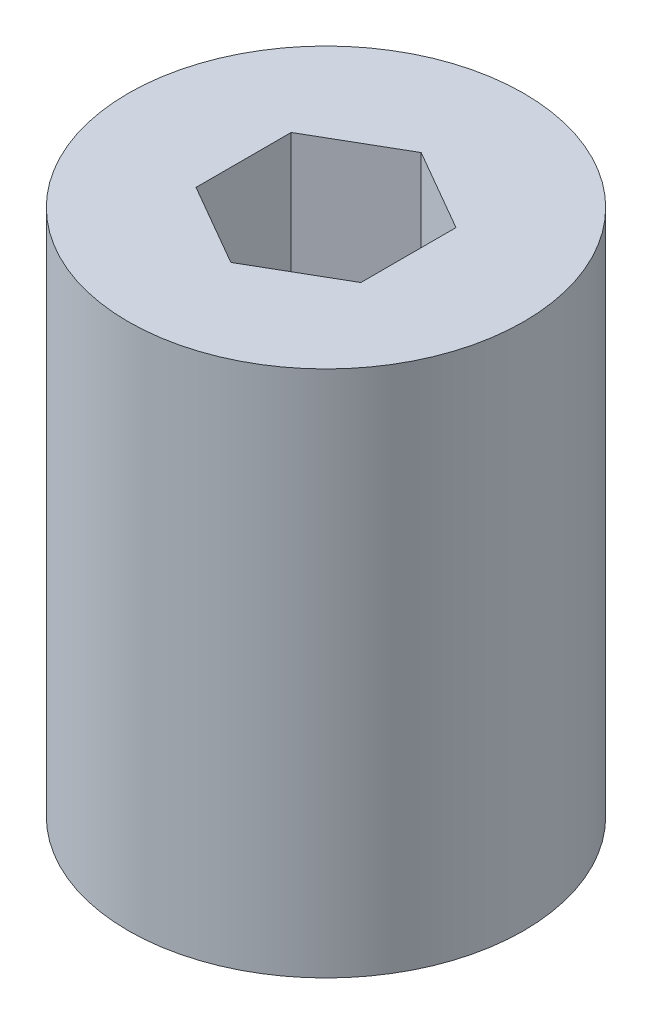
ISO-10303-21;
HEADER;
FILE_DESCRIPTION(('STEP AP214'),'2;1');
FILE_NAME('part.step','',(''),(''),'','','');
FILE_SCHEMA(('AUTOMOTIVE_DESIGN { 1 0 10303 214 1 1 1 1 }'));
ENDSEC;
DATA;
#1=APPLICATION_CONTEXT('core data for automotive mechanical design processes');
#2=APPLICATION_PROTOCOL_DEFINITION('international standard','automotive_design',2000,#1);
#3=PRODUCT_CONTEXT('',#1,'mechanical');
#4=PRODUCT('Part','Part','',(#3));
#5=PRODUCT_RELATED_PRODUCT_CATEGORY('part','',(#4));
#6=PRODUCT_DEFINITION_FORMATION('','',#4);
#7=PRODUCT_DEFINITION_CONTEXT('part definition',#1,'design');
#8=PRODUCT_DEFINITION('design','',#6,#7);
#9=PRODUCT_DEFINITION_SHAPE('','',#8);
#10=(LENGTH_UNIT() NAMED_UNIT(*) SI_UNIT(.MILLI.,.METRE.));
#11=(NAMED_UNIT(*) PLANE_ANGLE_UNIT() SI_UNIT($,.RADIAN.));
#12=(NAMED_UNIT(*) SI_UNIT($,.STERADIAN.) SOLID_ANGLE_UNIT());
#13=UNCERTAINTY_MEASURE_WITH_UNIT(LENGTH_MEASURE(1.E-05),#10,'distance_accuracy_value','');
#14=(GEOMETRIC_REPRESENTATION_CONTEXT(3) GLOBAL_UNCERTAINTY_ASSIGNED_CONTEXT((#13)) GLOBAL_UNIT_ASSIGNED_CONTEXT((#10,
#11,#12)) REPRESENTATION_CONTEXT('',''));
#15=CARTESIAN_POINT('',(0.,0.,0.));
#16=DIRECTION('',(0.,0.,1.));
#17=DIRECTION('',(1.,0.,0.));
#18=AXIS2_PLACEMENT_3D('',#15,#16,#17);
#19=CARTESIAN_POINT('',(0.,0.,0.));
#20=DIRECTION('',(0.,-1.,0.));
#21=DIRECTION('',(0.,0.,-1.));
#22=AXIS2_PLACEMENT_3D('',#19,#20,#21);
#23=PLANE('',#22);
#24=CARTESIAN_POINT('',(0.,0.,0.));
#25=DIRECTION('',(0.,-1.,0.));
#26=DIRECTION('',(0.,0.,-1.));
#27=AXIS2_PLACEMENT_3D('',#24,#25,#26);
#28=CIRCLE('',#27,6.);
#29=CARTESIAN_POINT('',(0.,0.,-6.));
#30=VERTEX_POINT('',#29);
#31=EDGE_CURVE('E9',#30,#30,#28,.T.);
#32=ORIENTED_EDGE('',*,*,#31,.F.);
#33=EDGE_LOOP('',(#32));
#34=FACE_BOUND('',#33,.T.);
#35=DIRECTION('',(0.,0.,1.));
#36=VECTOR('',#35,1.);
#37=CARTESIAN_POINT('',(2.5,0.,0.));
#38=LINE('',#37,#36);
#39=CARTESIAN_POINT('',(2.5,0.,-1.44337567297406));
#40=VERTEX_POINT('',#39);
#41=CARTESIAN_POINT('',(2.5,0.,1.44337567297406));
#42=VERTEX_POINT('',#41);
#43=EDGE_CURVE('E95',#40,#42,#38,.T.);
#44=ORIENTED_EDGE('',*,*,#43,.T.);
#45=DIRECTION('',(-0.866025403784439,0.,0.5));
#46=VECTOR('',#45,1.);
#47=CARTESIAN_POINT('',(1.25,0.,2.16506350946109));
#48=LINE('',#47,#46);
#49=CARTESIAN_POINT('',(0.,0.,2.88675134594813));
#50=VERTEX_POINT('',#49);
#51=EDGE_CURVE('E74',#42,#50,#48,.T.);
#52=ORIENTED_EDGE('',*,*,#51,.T.);
#53=DIRECTION('',(-0.866025403784439,0.,-0.5));
#54=VECTOR('',#53,1.);
#55=CARTESIAN_POINT('',(-1.25,0.,2.16506350946109));
#56=LINE('',#55,#54);
#57=CARTESIAN_POINT('',(-2.5,0.,1.44337567297406));
#58=VERTEX_POINT('',#57);
#59=EDGE_CURVE('E155',#50,#58,#56,.T.);
#60=ORIENTED_EDGE('',*,*,#59,.T.);
#61=DIRECTION('',(0.,0.,-1.));
#62=VECTOR('',#61,1.);
#63=CARTESIAN_POINT('',(-2.5,0.,0.));
#64=LINE('',#63,#62);
#65=CARTESIAN_POINT('',(-2.5,0.,-1.44337567297406));
#66=VERTEX_POINT('',#65);
#67=EDGE_CURVE('E122',#58,#66,#64,.T.);
#68=ORIENTED_EDGE('',*,*,#67,.T.);
#69=DIRECTION('',(0.866025403784439,0.,-0.5));
#70=VECTOR('',#69,1.);
#71=CARTESIAN_POINT('',(-1.25,0.,-2.16506350946109));
#72=LINE('',#71,#70);
#73=CARTESIAN_POINT('',(0.,0.,-2.88675134594813));
#74=VERTEX_POINT('',#73);
#75=EDGE_CURVE('E18',#66,#74,#72,.T.);
#76=ORIENTED_EDGE('',*,*,#75,.T.);
#77=DIRECTION('',(0.866025403784439,0.,0.5));
#78=VECTOR('',#77,1.);
#79=CARTESIAN_POINT('',(1.25,0.,-2.16506350946109));
#80=LINE('',#79,#78);
#81=EDGE_CURVE('E99',#74,#40,#80,.T.);
#82=ORIENTED_EDGE('',*,*,#81,.T.);
#83=EDGE_LOOP('',(#44,#52,#60,#68,#76,#82));
#84=FACE_BOUND('',#83,.T.);
#85=ADVANCED_FACE('F14',(#34,#84),#23,.F.);
#86=CARTESIAN_POINT('',(0.,-16.,0.));
#87=DIRECTION('',(0.,-1.,0.));
#88=DIRECTION('',(0.,0.,-1.));
#89=AXIS2_PLACEMENT_3D('',#86,#87,#88);
#90=PLANE('',#89);
#91=CARTESIAN_POINT('',(0.,-16.,0.));
#92=DIRECTION('',(0.,-1.,0.));
#93=DIRECTION('',(0.,0.,-1.));
#94=AXIS2_PLACEMENT_3D('',#91,#92,#93);
#95=CIRCLE('',#94,6.);
#96=CARTESIAN_POINT('',(0.,-16.,-6.));
#97=VERTEX_POINT('',#96);
#98=EDGE_CURVE('E25',#97,#97,#95,.T.);
#99=ORIENTED_EDGE('',*,*,#98,.T.);
#100=EDGE_LOOP('',(#99));
#101=FACE_BOUND('',#100,.T.);
#102=DIRECTION('',(0.,0.,1.));
#103=VECTOR('',#102,1.);
#104=CARTESIAN_POINT('',(2.5,-16.,0.));
#105=LINE('',#104,#103);
#106=CARTESIAN_POINT('',(2.5,-16.,-1.44337567297406));
#107=VERTEX_POINT('',#106);
#108=CARTESIAN_POINT('',(2.5,-16.,1.44337567297406));
#109=VERTEX_POINT('',#108);
#110=EDGE_CURVE('E97',#107,#109,#105,.T.);
#111=ORIENTED_EDGE('',*,*,#110,.F.);
#112=DIRECTION('',(0.866025403784439,0.,0.5));
#113=VECTOR('',#112,1.);
#114=CARTESIAN_POINT('',(1.25,-16.,-2.16506350946109));
#115=LINE('',#114,#113);
#116=CARTESIAN_POINT('',(0.,-16.,-2.88675134594813));
#117=VERTEX_POINT('',#116);
#118=EDGE_CURVE('E147',#117,#107,#115,.T.);
#119=ORIENTED_EDGE('',*,*,#118,.F.);
#120=DIRECTION('',(0.866025403784439,0.,-0.5));
#121=VECTOR('',#120,1.);
#122=CARTESIAN_POINT('',(-1.25,-16.,-2.16506350946109));
#123=LINE('',#122,#121);
#124=CARTESIAN_POINT('',(-2.5,-16.,-1.44337567297406));
#125=VERTEX_POINT('',#124);
#126=EDGE_CURVE('E127',#125,#117,#123,.T.);
#127=ORIENTED_EDGE('',*,*,#126,.F.);
#128=DIRECTION('',(0.,0.,-1.));
#129=VECTOR('',#128,1.);
#130=CARTESIAN_POINT('',(-2.5,-16.,0.));
#131=LINE('',#130,#129);
#132=CARTESIAN_POINT('',(-2.5,-16.,1.44337567297406));
#133=VERTEX_POINT('',#132);
#134=EDGE_CURVE('E121',#133,#125,#131,.T.);
#135=ORIENTED_EDGE('',*,*,#134,.F.);
#136=DIRECTION('',(-0.866025403784439,0.,-0.5));
#137=VECTOR('',#136,1.);
#138=CARTESIAN_POINT('',(-1.25,-16.,2.16506350946109));
#139=LINE('',#138,#137);
#140=CARTESIAN_POINT('',(0.,-16.,2.88675134594813));
#141=VERTEX_POINT('',#140);
#142=EDGE_CURVE('E90',#141,#133,#139,.T.);
#143=ORIENTED_EDGE('',*,*,#142,.F.);
#144=DIRECTION('',(-0.866025403784439,0.,0.5));
#145=VECTOR('',#144,1.);
#146=CARTESIAN_POINT('',(1.25,-16.,2.16506350946109));
#147=LINE('',#146,#145);
#148=EDGE_CURVE('E61',#109,#141,#147,.T.);
#149=ORIENTED_EDGE('',*,*,#148,.F.);
#150=EDGE_LOOP('',(#111,#119,#127,#135,#143,#149));
#151=FACE_BOUND('',#150,.T.);
#152=ADVANCED_FACE('F161',(#101,#151),#90,.T.);
#153=CARTESIAN_POINT('',(0.,-16.,0.));
#154=DIRECTION('',(0.,1.,0.));
#155=DIRECTION('',(0.,0.,1.));
#156=AXIS2_PLACEMENT_3D('',#153,#154,#155);
#157=CYLINDRICAL_SURFACE('',#156,6.);
#158=ORIENTED_EDGE('',*,*,#31,.T.);
#159=EDGE_LOOP('',(#158));
#160=FACE_BOUND('',#159,.T.);
#161=ORIENTED_EDGE('',*,*,#98,.F.);
#162=EDGE_LOOP('',(#161));
#163=FACE_BOUND('',#162,.T.);
#164=ADVANCED_FACE('F16',(#160,#163),#157,.T.);
#165=CARTESIAN_POINT('',(1.25,-16.,2.16506350946109));
#166=DIRECTION('',(-0.5,0.,-0.866025403784439));
#167=DIRECTION('',(-0.866025403784439,0.,0.5));
#168=AXIS2_PLACEMENT_3D('',#165,#166,#167);
#169=PLANE('',#168);
#170=ORIENTED_EDGE('',*,*,#51,.F.);
#171=DIRECTION('',(0.,1.,0.));
#172=VECTOR('',#171,1.);
#173=CARTESIAN_POINT('',(2.5,-16.,1.44337567297406));
#174=LINE('',#173,#172);
#175=EDGE_CURVE('E84',#109,#42,#174,.T.);
#176=ORIENTED_EDGE('',*,*,#175,.F.);
#177=ORIENTED_EDGE('',*,*,#148,.T.);
#178=DIRECTION('',(0.,1.,0.));
#179=VECTOR('',#178,1.);
#180=CARTESIAN_POINT('',(0.,-16.,2.88675134594813));
#181=LINE('',#180,#179);
#182=EDGE_CURVE('E87',#141,#50,#181,.T.);
#183=ORIENTED_EDGE('',*,*,#182,.T.);
#184=EDGE_LOOP('',(#170,#176,#177,#183));
#185=FACE_BOUND('',#184,.T.);
#186=ADVANCED_FACE('F83',(#185),#169,.T.);
#187=CARTESIAN_POINT('',(-1.25,-16.,2.16506350946109));
#188=DIRECTION('',(0.5,0.,-0.866025403784439));
#189=DIRECTION('',(0.,-1.,0.));
#190=AXIS2_PLACEMENT_3D('',#187,#188,#189);
#191=PLANE('',#190);
#192=ORIENTED_EDGE('',*,*,#59,.F.);
#193=ORIENTED_EDGE('',*,*,#182,.F.);
#194=ORIENTED_EDGE('',*,*,#142,.T.);
#195=DIRECTION('',(0.,1.,0.));
#196=VECTOR('',#195,1.);
#197=CARTESIAN_POINT('',(-2.5,-16.,1.44337567297406));
#198=LINE('',#197,#196);
#199=EDGE_CURVE('E117',#133,#58,#198,.T.);
#200=ORIENTED_EDGE('',*,*,#199,.T.);
#201=EDGE_LOOP('',(#192,#193,#194,#200));
#202=FACE_BOUND('',#201,.T.);
#203=ADVANCED_FACE('F170',(#202),#191,.T.);
#204=CARTESIAN_POINT('',(-2.5,-16.,0.));
#205=DIRECTION('',(1.,0.,0.));
#206=DIRECTION('',(0.,0.,1.));
#207=AXIS2_PLACEMENT_3D('',#204,#205,#206);
#208=PLANE('',#207);
#209=ORIENTED_EDGE('',*,*,#67,.F.);
#210=ORIENTED_EDGE('',*,*,#199,.F.);
#211=ORIENTED_EDGE('',*,*,#134,.T.);
#212=DIRECTION('',(0.,1.,0.));
#213=VECTOR('',#212,1.);
#214=CARTESIAN_POINT('',(-2.5,-16.,-1.44337567297406));
#215=LINE('',#214,#213);
#216=EDGE_CURVE('E123',#125,#66,#215,.T.);
#217=ORIENTED_EDGE('',*,*,#216,.T.);
#218=EDGE_LOOP('',(#209,#210,#211,#217));
#219=FACE_BOUND('',#218,.T.);
#220=ADVANCED_FACE('F180',(#219),#208,.T.);
#221=CARTESIAN_POINT('',(-1.25,-16.,-2.16506350946109));
#222=DIRECTION('',(0.5,0.,0.866025403784439));
#223=DIRECTION('',(0.,-1.,0.));
#224=AXIS2_PLACEMENT_3D('',#221,#222,#223);
#225=PLANE('',#224);
#226=ORIENTED_EDGE('',*,*,#75,.F.);
#227=ORIENTED_EDGE('',*,*,#216,.F.);
#228=ORIENTED_EDGE('',*,*,#126,.T.);
#229=DIRECTION('',(0.,1.,0.));
#230=VECTOR('',#229,1.);
#231=CARTESIAN_POINT('',(0.,-16.,-2.88675134594813));
#232=LINE('',#231,#230);
#233=EDGE_CURVE('E116',#117,#74,#232,.T.);
#234=ORIENTED_EDGE('',*,*,#233,.T.);
#235=EDGE_LOOP('',(#226,#227,#228,#234));
#236=FACE_BOUND('',#235,.T.);
#237=ADVANCED_FACE('F181',(#236),#225,.T.);
#238=CARTESIAN_POINT('',(1.25,-16.,-2.16506350946109));
#239=DIRECTION('',(-0.5,0.,0.866025403784439));
#240=DIRECTION('',(0.,1.,0.));
#241=AXIS2_PLACEMENT_3D('',#238,#239,#240);
#242=PLANE('',#241);
#243=ORIENTED_EDGE('',*,*,#81,.F.);
#244=ORIENTED_EDGE('',*,*,#233,.F.);
#245=ORIENTED_EDGE('',*,*,#118,.T.);
#246=DIRECTION('',(0.,1.,0.));
#247=VECTOR('',#246,1.);
#248=CARTESIAN_POINT('',(2.5,-16.,-1.44337567297406));
#249=LINE('',#248,#247);
#250=EDGE_CURVE('E105',#107,#40,#249,.T.);
#251=ORIENTED_EDGE('',*,*,#250,.T.);
#252=EDGE_LOOP('',(#243,#244,#245,#251));
#253=FACE_BOUND('',#252,.T.);
#254=ADVANCED_FACE('F183',(#253),#242,.T.);
#255=CARTESIAN_POINT('',(2.5,-16.,0.));
#256=DIRECTION('',(-1.,0.,0.));
#257=DIRECTION('',(0.,0.,1.));
#258=AXIS2_PLACEMENT_3D('',#255,#256,#257);
#259=PLANE('',#258);
#260=ORIENTED_EDGE('',*,*,#43,.F.);
#261=ORIENTED_EDGE('',*,*,#250,.F.);
#262=ORIENTED_EDGE('',*,*,#110,.T.);
#263=ORIENTED_EDGE('',*,*,#175,.T.);
#264=EDGE_LOOP('',(#260,#261,#262,#263));
#265=FACE_BOUND('',#264,.T.);
#266=ADVANCED_FACE('F93',(#265),#259,.T.);
#267=CLOSED_SHELL('',(#85,#152,#164,#186,#203,#220,#237,#254,#266));
#268=MANIFOLD_SOLID_BREP('B1',#267);
#269=ADVANCED_BREP_SHAPE_REPRESENTATION('',(#18,#268),#14);
#270=SHAPE_DEFINITION_REPRESENTATION(#9,#269);
ENDSEC;
END-ISO-10303-21;
